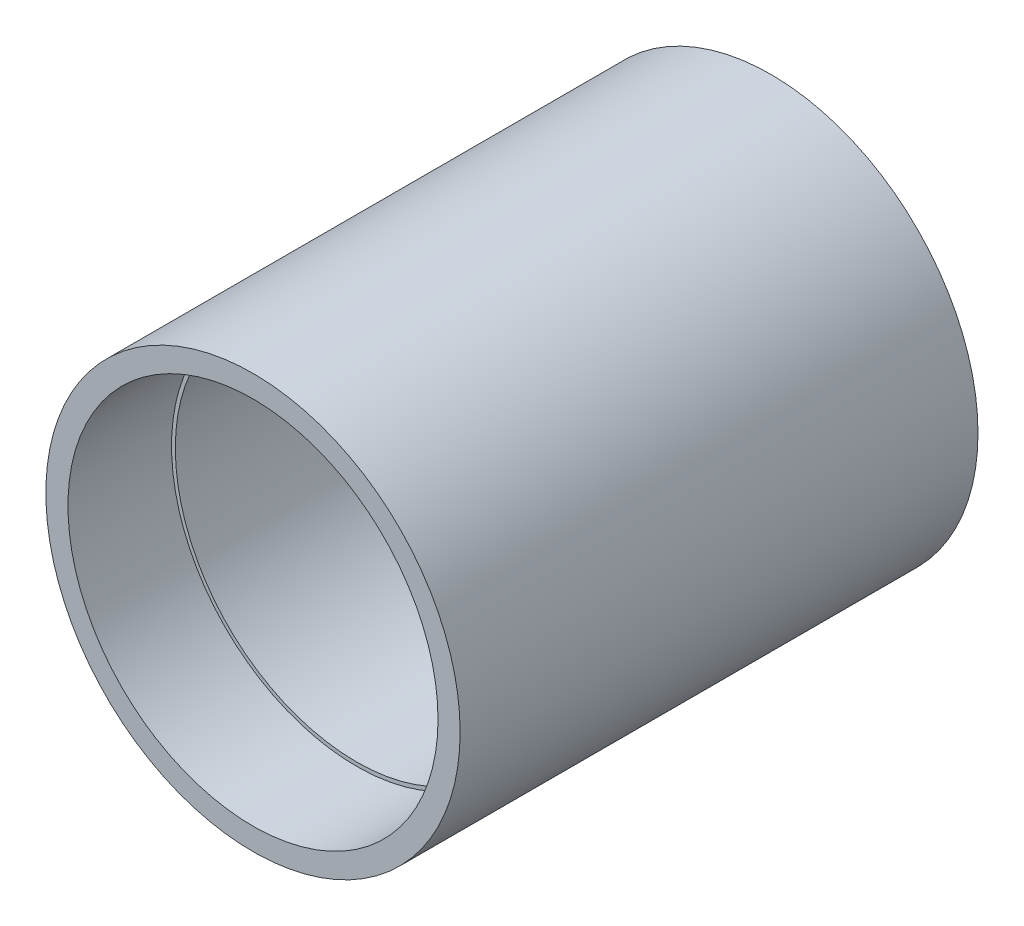
ISO-10303-21;
HEADER;
FILE_DESCRIPTION(('STEP AP214'),'2;1');
FILE_NAME('part.step','',(''),(''),'','','');
FILE_SCHEMA(('AUTOMOTIVE_DESIGN { 1 0 10303 214 1 1 1 1 }'));
ENDSEC;
DATA;
#1=APPLICATION_CONTEXT('core data for automotive mechanical design processes');
#2=APPLICATION_PROTOCOL_DEFINITION('international standard','automotive_design',2000,#1);
#3=PRODUCT_CONTEXT('',#1,'mechanical');
#4=PRODUCT('Part','Part','',(#3));
#5=PRODUCT_RELATED_PRODUCT_CATEGORY('part','',(#4));
#6=PRODUCT_DEFINITION_FORMATION('','',#4);
#7=PRODUCT_DEFINITION_CONTEXT('part definition',#1,'design');
#8=PRODUCT_DEFINITION('design','',#6,#7);
#9=PRODUCT_DEFINITION_SHAPE('','',#8);
#10=(LENGTH_UNIT() NAMED_UNIT(*) SI_UNIT(.MILLI.,.METRE.));
#11=(NAMED_UNIT(*) PLANE_ANGLE_UNIT() SI_UNIT($,.RADIAN.));
#12=(NAMED_UNIT(*) SI_UNIT($,.STERADIAN.) SOLID_ANGLE_UNIT());
#13=UNCERTAINTY_MEASURE_WITH_UNIT(LENGTH_MEASURE(1.E-05),#10,'distance_accuracy_value','');
#14=(GEOMETRIC_REPRESENTATION_CONTEXT(3) GLOBAL_UNCERTAINTY_ASSIGNED_CONTEXT((#13)) GLOBAL_UNIT_ASSIGNED_CONTEXT((#10,
#11,#12)) REPRESENTATION_CONTEXT('',''));
#15=CARTESIAN_POINT('',(0.,0.,0.));
#16=DIRECTION('',(0.,0.,1.));
#17=DIRECTION('',(1.,0.,0.));
#18=AXIS2_PLACEMENT_3D('',#15,#16,#17);
#19=CARTESIAN_POINT('',(0.,0.,100.));
#20=DIRECTION('',(0.,0.,-1.));
#21=DIRECTION('',(-1.,0.,0.));
#22=AXIS2_PLACEMENT_3D('',#19,#20,#21);
#23=CYLINDRICAL_SURFACE('',#22,35.);
#24=CARTESIAN_POINT('',(0.,0.,0.));
#25=DIRECTION('',(0.,0.,1.));
#26=DIRECTION('',(1.,0.,0.));
#27=AXIS2_PLACEMENT_3D('',#24,#25,#26);
#28=CIRCLE('',#27,35.);
#29=CARTESIAN_POINT('',(35.,0.,0.));
#30=VERTEX_POINT('',#29);
#31=EDGE_CURVE('E57',#30,#30,#28,.T.);
#32=ORIENTED_EDGE('',*,*,#31,.F.);
#33=EDGE_LOOP('',(#32));
#34=FACE_BOUND('',#33,.T.);
#35=CARTESIAN_POINT('',(0.,0.,80.));
#36=DIRECTION('',(0.,0.,1.));
#37=DIRECTION('',(1.,0.,0.));
#38=AXIS2_PLACEMENT_3D('',#35,#36,#37);
#39=CIRCLE('',#38,35.);
#40=CARTESIAN_POINT('',(35.,0.,80.));
#41=VERTEX_POINT('',#40);
#42=EDGE_CURVE('E45',#41,#41,#39,.T.);
#43=ORIENTED_EDGE('',*,*,#42,.T.);
#44=EDGE_LOOP('',(#43));
#45=FACE_BOUND('',#44,.T.);
#46=ADVANCED_FACE('F41',(#34,#45),#23,.F.);
#47=CARTESIAN_POINT('',(0.,0.,100.));
#48=DIRECTION('',(0.,0.,1.));
#49=DIRECTION('',(1.,0.,0.));
#50=AXIS2_PLACEMENT_3D('',#47,#48,#49);
#51=PLANE('',#50);
#52=CARTESIAN_POINT('',(0.,0.,100.));
#53=DIRECTION('',(0.,0.,1.));
#54=DIRECTION('',(1.,0.,0.));
#55=AXIS2_PLACEMENT_3D('',#52,#53,#54);
#56=CIRCLE('',#55,35.73);
#57=CARTESIAN_POINT('',(35.73,0.,100.));
#58=VERTEX_POINT('',#57);
#59=EDGE_CURVE('E62',#58,#58,#56,.T.);
#60=ORIENTED_EDGE('',*,*,#59,.F.);
#61=EDGE_LOOP('',(#60));
#62=FACE_BOUND('',#61,.T.);
#63=CARTESIAN_POINT('',(0.,0.,100.));
#64=DIRECTION('',(0.,0.,1.));
#65=DIRECTION('',(1.,0.,0.));
#66=AXIS2_PLACEMENT_3D('',#63,#64,#65);
#67=CIRCLE('',#66,40.);
#68=CARTESIAN_POINT('',(40.,0.,100.));
#69=VERTEX_POINT('',#68);
#70=EDGE_CURVE('E10',#69,#69,#67,.T.);
#71=ORIENTED_EDGE('',*,*,#70,.T.);
#72=EDGE_LOOP('',(#71));
#73=FACE_BOUND('',#72,.T.);
#74=ADVANCED_FACE('F88',(#62,#73),#51,.T.);
#75=CARTESIAN_POINT('',(0.,0.,0.));
#76=DIRECTION('',(0.,0.,1.));
#77=DIRECTION('',(1.,0.,0.));
#78=AXIS2_PLACEMENT_3D('',#75,#76,#77);
#79=PLANE('',#78);
#80=CARTESIAN_POINT('',(0.,0.,0.));
#81=DIRECTION('',(0.,0.,1.));
#82=DIRECTION('',(1.,0.,0.));
#83=AXIS2_PLACEMENT_3D('',#80,#81,#82);
#84=CIRCLE('',#83,40.);
#85=CARTESIAN_POINT('',(40.,0.,0.));
#86=VERTEX_POINT('',#85);
#87=EDGE_CURVE('E50',#86,#86,#84,.T.);
#88=ORIENTED_EDGE('',*,*,#87,.F.);
#89=EDGE_LOOP('',(#88));
#90=FACE_BOUND('',#89,.T.);
#91=ORIENTED_EDGE('',*,*,#31,.T.);
#92=EDGE_LOOP('',(#91));
#93=FACE_BOUND('',#92,.T.);
#94=ADVANCED_FACE('F94',(#90,#93),#79,.F.);
#95=CARTESIAN_POINT('',(0.,0.,100.));
#96=DIRECTION('',(0.,0.,-1.));
#97=DIRECTION('',(-1.,0.,0.));
#98=AXIS2_PLACEMENT_3D('',#95,#96,#97);
#99=CYLINDRICAL_SURFACE('',#98,40.);
#100=ORIENTED_EDGE('',*,*,#70,.F.);
#101=EDGE_LOOP('',(#100));
#102=FACE_BOUND('',#101,.T.);
#103=ORIENTED_EDGE('',*,*,#87,.T.);
#104=EDGE_LOOP('',(#103));
#105=FACE_BOUND('',#104,.T.);
#106=ADVANCED_FACE('F43',(#102,#105),#99,.T.);
#107=CARTESIAN_POINT('',(0.,0.,80.));
#108=DIRECTION('',(0.,0.,1.));
#109=DIRECTION('',(1.,0.,0.));
#110=AXIS2_PLACEMENT_3D('',#107,#108,#109);
#111=CYLINDRICAL_SURFACE('',#110,35.73);
#112=CARTESIAN_POINT('',(0.,0.,80.));
#113=DIRECTION('',(0.,0.,1.));
#114=DIRECTION('',(1.,0.,0.));
#115=AXIS2_PLACEMENT_3D('',#112,#113,#114);
#116=CIRCLE('',#115,35.73);
#117=CARTESIAN_POINT('',(35.73,0.,80.));
#118=VERTEX_POINT('',#117);
#119=EDGE_CURVE('E66',#118,#118,#116,.T.);
#120=ORIENTED_EDGE('',*,*,#119,.F.);
#121=EDGE_LOOP('',(#120));
#122=FACE_BOUND('',#121,.T.);
#123=ORIENTED_EDGE('',*,*,#59,.T.);
#124=EDGE_LOOP('',(#123));
#125=FACE_BOUND('',#124,.T.);
#126=ADVANCED_FACE('F80',(#122,#125),#111,.F.);
#127=CARTESIAN_POINT('',(0.,0.,80.));
#128=DIRECTION('',(0.,0.,1.));
#129=DIRECTION('',(1.,0.,0.));
#130=AXIS2_PLACEMENT_3D('',#127,#128,#129);
#131=PLANE('',#130);
#132=ORIENTED_EDGE('',*,*,#42,.F.);
#133=EDGE_LOOP('',(#132));
#134=FACE_BOUND('',#133,.T.);
#135=ORIENTED_EDGE('',*,*,#119,.T.);
#136=EDGE_LOOP('',(#135));
#137=FACE_BOUND('',#136,.T.);
#138=ADVANCED_FACE('F78',(#134,#137),#131,.T.);
#139=CLOSED_SHELL('',(#46,#74,#94,#106,#126,#138));
#140=MANIFOLD_SOLID_BREP('B2',#139);
#141=ADVANCED_BREP_SHAPE_REPRESENTATION('',(#18,#140),#14);
#142=SHAPE_DEFINITION_REPRESENTATION(#9,#141);
ENDSEC;
END-ISO-10303-21;
